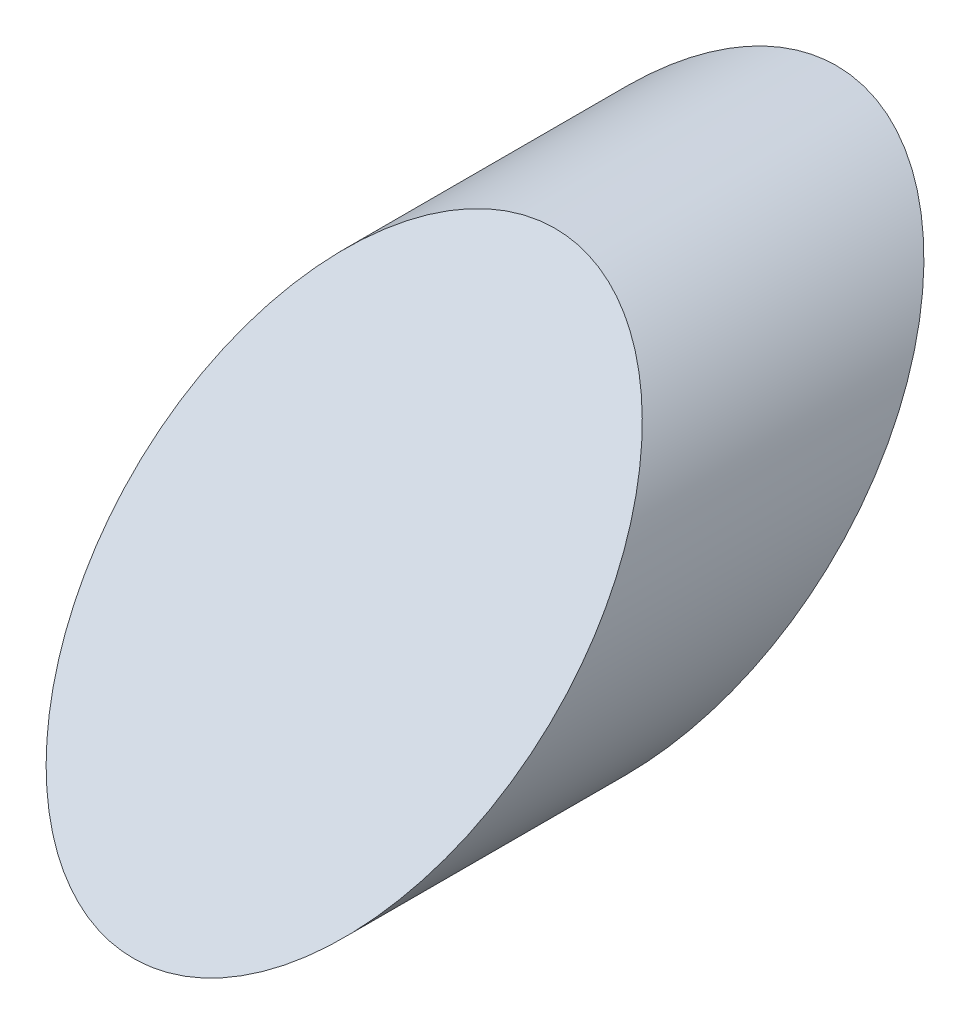
ISO-10303-21;
HEADER;
FILE_DESCRIPTION(('STEP AP214'),'2;1');
FILE_NAME('part.step','',(''),(''),'','','');
FILE_SCHEMA(('AUTOMOTIVE_DESIGN { 1 0 10303 214 1 1 1 1 }'));
ENDSEC;
DATA;
#1=APPLICATION_CONTEXT('core data for automotive mechanical design processes');
#2=APPLICATION_PROTOCOL_DEFINITION('international standard','automotive_design',2000,#1);
#3=PRODUCT_CONTEXT('',#1,'mechanical');
#4=PRODUCT('Part','Part','',(#3));
#5=PRODUCT_RELATED_PRODUCT_CATEGORY('part','',(#4));
#6=PRODUCT_DEFINITION_FORMATION('','',#4);
#7=PRODUCT_DEFINITION_CONTEXT('part definition',#1,'design');
#8=PRODUCT_DEFINITION('design','',#6,#7);
#9=PRODUCT_DEFINITION_SHAPE('','',#8);
#10=(LENGTH_UNIT() NAMED_UNIT(*) SI_UNIT(.MILLI.,.METRE.));
#11=(NAMED_UNIT(*) PLANE_ANGLE_UNIT() SI_UNIT($,.RADIAN.));
#12=(NAMED_UNIT(*) SI_UNIT($,.STERADIAN.) SOLID_ANGLE_UNIT());
#13=UNCERTAINTY_MEASURE_WITH_UNIT(LENGTH_MEASURE(1.E-05),#10,'distance_accuracy_value','');
#14=(GEOMETRIC_REPRESENTATION_CONTEXT(3) GLOBAL_UNCERTAINTY_ASSIGNED_CONTEXT((#13)) GLOBAL_UNIT_ASSIGNED_CONTEXT((#10,
#11,#12)) REPRESENTATION_CONTEXT('',''));
#15=CARTESIAN_POINT('',(0.,0.,0.));
#16=DIRECTION('',(0.,0.,1.));
#17=DIRECTION('',(1.,0.,0.));
#18=AXIS2_PLACEMENT_3D('',#15,#16,#17);
#19=CARTESIAN_POINT('',(0.,0.,25.4));
#20=DIRECTION('',(0.,0.,-1.));
#21=DIRECTION('',(-1.,0.,0.));
#22=AXIS2_PLACEMENT_3D('',#19,#20,#21);
#23=CYLINDRICAL_SURFACE('',#22,6.35);
#24=CARTESIAN_POINT('',(0.,0.,6.35000000000006));
#25=DIRECTION('',(0.,-0.707106781186551,-0.707106781186544));
#26=DIRECTION('',(0.,0.707106781186544,-0.707106781186551));
#27=AXIS2_PLACEMENT_3D('',#24,#25,#26);
#28=ELLIPSE('',#27,8.9802561210692,6.35);
#29=CARTESIAN_POINT('',(0.,6.35,0.));
#30=VERTEX_POINT('',#29);
#31=EDGE_CURVE('E39',#30,#30,#28,.T.);
#32=ORIENTED_EDGE('',*,*,#31,.F.);
#33=EDGE_LOOP('',(#32));
#34=FACE_BOUND('',#33,.T.);
#35=CARTESIAN_POINT('',(0.,0.,14.8352813742387));
#36=DIRECTION('',(0.,0.707106781186551,0.707106781186544));
#37=DIRECTION('',(0.,0.707106781186544,-0.707106781186551));
#38=AXIS2_PLACEMENT_3D('',#35,#36,#37);
#39=ELLIPSE('',#38,8.9802561210692,6.35);
#40=CARTESIAN_POINT('',(0.,6.35,8.48528137423862));
#41=VERTEX_POINT('',#40);
#42=EDGE_CURVE('E11',#41,#41,#39,.T.);
#43=ORIENTED_EDGE('',*,*,#42,.F.);
#44=EDGE_LOOP('',(#43));
#45=FACE_BOUND('',#44,.T.);
#46=ADVANCED_FACE('F33',(#34,#45),#23,.T.);
#47=CARTESIAN_POINT('',(-6.35,11.922378099149,-5.57237809914902));
#48=DIRECTION('',(0.,-0.707106781186551,-0.707106781186544));
#49=DIRECTION('',(0.,0.707106781186544,-0.707106781186551));
#50=AXIS2_PLACEMENT_3D('',#47,#48,#49);
#51=PLANE('',#50);
#52=ORIENTED_EDGE('',*,*,#31,.T.);
#53=EDGE_LOOP('',(#52));
#54=FACE_BOUND('',#53,.T.);
#55=ADVANCED_FACE('F45',(#54),#51,.T.);
#56=CARTESIAN_POINT('',(-6.35,-10.7822289532547,25.6175103274935));
#57=DIRECTION('',(0.,0.707106781186551,0.707106781186544));
#58=DIRECTION('',(0.,-0.707106781186544,0.707106781186551));
#59=AXIS2_PLACEMENT_3D('',#56,#57,#58);
#60=PLANE('',#59);
#61=ORIENTED_EDGE('',*,*,#42,.T.);
#62=EDGE_LOOP('',(#61));
#63=FACE_BOUND('',#62,.T.);
#64=ADVANCED_FACE('F52',(#63),#60,.T.);
#65=CLOSED_SHELL('',(#46,#55,#64));
#66=MANIFOLD_SOLID_BREP('B2',#65);
#67=ADVANCED_BREP_SHAPE_REPRESENTATION('',(#18,#66),#14);
#68=SHAPE_DEFINITION_REPRESENTATION(#9,#67);
ENDSEC;
END-ISO-10303-21;
